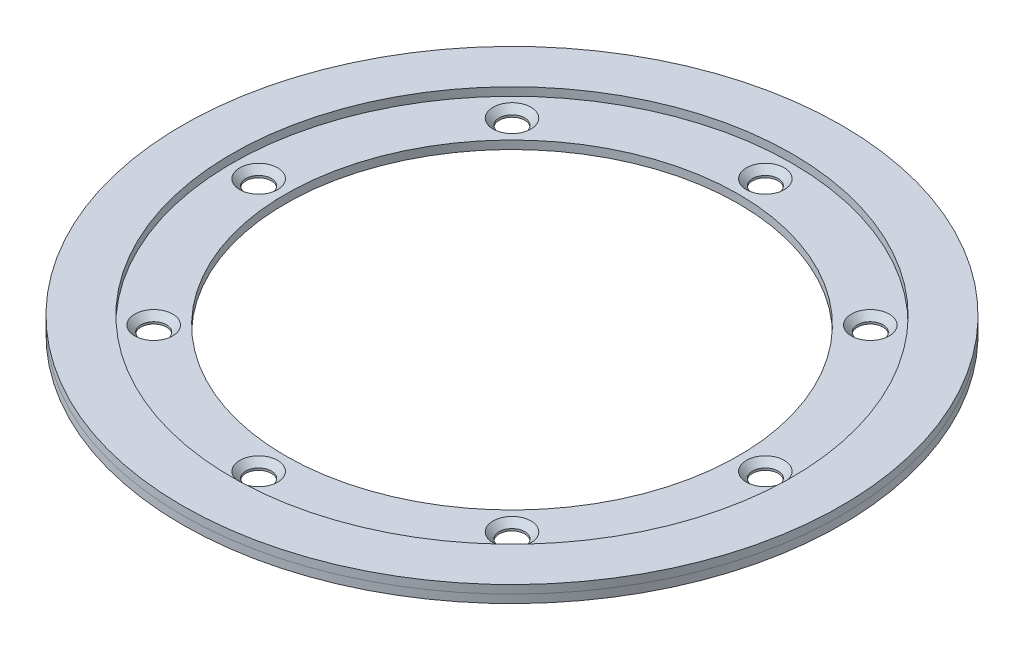
ISO-10303-21;
HEADER;
FILE_DESCRIPTION(('STEP AP214'),'2;1');
FILE_NAME('part.step','',(''),(''),'','','');
FILE_SCHEMA(('AUTOMOTIVE_DESIGN { 1 0 10303 214 1 1 1 1 }'));
ENDSEC;
DATA;
#1=APPLICATION_CONTEXT('core data for automotive mechanical design processes');
#2=APPLICATION_PROTOCOL_DEFINITION('international standard','automotive_design',2000,#1);
#3=PRODUCT_CONTEXT('',#1,'mechanical');
#4=PRODUCT('Part','Part','',(#3));
#5=PRODUCT_RELATED_PRODUCT_CATEGORY('part','',(#4));
#6=PRODUCT_DEFINITION_FORMATION('','',#4);
#7=PRODUCT_DEFINITION_CONTEXT('part definition',#1,'design');
#8=PRODUCT_DEFINITION('design','',#6,#7);
#9=PRODUCT_DEFINITION_SHAPE('','',#8);
#10=(LENGTH_UNIT() NAMED_UNIT(*) SI_UNIT(.MILLI.,.METRE.));
#11=(NAMED_UNIT(*) PLANE_ANGLE_UNIT() SI_UNIT($,.RADIAN.));
#12=(NAMED_UNIT(*) SI_UNIT($,.STERADIAN.) SOLID_ANGLE_UNIT());
#13=UNCERTAINTY_MEASURE_WITH_UNIT(LENGTH_MEASURE(1.E-05),#10,'distance_accuracy_value','');
#14=(GEOMETRIC_REPRESENTATION_CONTEXT(3) GLOBAL_UNCERTAINTY_ASSIGNED_CONTEXT((#13)) GLOBAL_UNIT_ASSIGNED_CONTEXT((#10,
#11,#12)) REPRESENTATION_CONTEXT('',''));
#15=CARTESIAN_POINT('',(0.,0.,0.));
#16=DIRECTION('',(0.,0.,1.));
#17=DIRECTION('',(1.,0.,0.));
#18=AXIS2_PLACEMENT_3D('',#15,#16,#17);
#19=CARTESIAN_POINT('',(0.,1.,-34.));
#20=DIRECTION('',(0.,1.,0.));
#21=DIRECTION('',(0.,0.,1.));
#22=AXIS2_PLACEMENT_3D('',#19,#20,#21);
#23=PLANE('',#22);
#24=CARTESIAN_POINT('',(0.,1.,0.));
#25=DIRECTION('',(0.,1.,0.));
#26=DIRECTION('',(0.,0.,1.));
#27=AXIS2_PLACEMENT_3D('',#24,#25,#26);
#28=CIRCLE('',#27,40.);
#29=CARTESIAN_POINT('',(0.,1.,40.));
#30=VERTEX_POINT('',#29);
#31=EDGE_CURVE('E47',#30,#30,#28,.T.);
#32=ORIENTED_EDGE('',*,*,#31,.T.);
#33=EDGE_LOOP('',(#32));
#34=FACE_BOUND('',#33,.T.);
#35=CARTESIAN_POINT('',(-21.7435335214861,1.,-21.7435335214866));
#36=DIRECTION('',(0.,1.,0.));
#37=DIRECTION('',(0.,0.,1.));
#38=AXIS2_PLACEMENT_3D('',#35,#36,#37);
#39=CIRCLE('',#38,2.3);
#40=CARTESIAN_POINT('',(-21.7435335214861,1.,-19.4435335214866));
#41=VERTEX_POINT('',#40);
#42=EDGE_CURVE('E11',#41,#41,#39,.T.);
#43=ORIENTED_EDGE('',*,*,#42,.F.);
#44=EDGE_LOOP('',(#43));
#45=FACE_BOUND('',#44,.T.);
#46=CARTESIAN_POINT('',(-30.75,1.,-3.22089153508279E-13));
#47=DIRECTION('',(0.,1.,0.));
#48=DIRECTION('',(0.,0.,1.));
#49=AXIS2_PLACEMENT_3D('',#46,#47,#48);
#50=CIRCLE('',#49,2.3);
#51=CARTESIAN_POINT('',(-30.75,1.,2.29999999999968));
#52=VERTEX_POINT('',#51);
#53=EDGE_CURVE('E60',#52,#52,#50,.T.);
#54=ORIENTED_EDGE('',*,*,#53,.F.);
#55=EDGE_LOOP('',(#54));
#56=FACE_BOUND('',#55,.T.);
#57=CARTESIAN_POINT('',(-21.7435335214865,1.,21.7435335214861));
#58=DIRECTION('',(0.,1.,0.));
#59=DIRECTION('',(0.,0.,1.));
#60=AXIS2_PLACEMENT_3D('',#57,#58,#59);
#61=CIRCLE('',#60,2.3);
#62=CARTESIAN_POINT('',(-21.7435335214865,1.,24.0435335214861));
#63=VERTEX_POINT('',#62);
#64=EDGE_CURVE('E69',#63,#63,#61,.T.);
#65=ORIENTED_EDGE('',*,*,#64,.F.);
#66=EDGE_LOOP('',(#65));
#67=FACE_BOUND('',#66,.T.);
#68=CARTESIAN_POINT('',(0.,1.,30.75));
#69=DIRECTION('',(0.,1.,0.));
#70=DIRECTION('',(0.,0.,1.));
#71=AXIS2_PLACEMENT_3D('',#68,#69,#70);
#72=CIRCLE('',#71,2.3);
#73=CARTESIAN_POINT('',(0.,1.,33.05));
#74=VERTEX_POINT('',#73);
#75=EDGE_CURVE('E78',#74,#74,#72,.T.);
#76=ORIENTED_EDGE('',*,*,#75,.F.);
#77=EDGE_LOOP('',(#76));
#78=FACE_BOUND('',#77,.T.);
#79=CARTESIAN_POINT('',(21.7435335214862,1.,21.7435335214865));
#80=DIRECTION('',(0.,1.,0.));
#81=DIRECTION('',(0.,0.,1.));
#82=AXIS2_PLACEMENT_3D('',#79,#80,#81);
#83=CIRCLE('',#82,2.3);
#84=CARTESIAN_POINT('',(21.7435335214862,1.,24.0435335214864));
#85=VERTEX_POINT('',#84);
#86=EDGE_CURVE('E87',#85,#85,#83,.T.);
#87=ORIENTED_EDGE('',*,*,#86,.F.);
#88=EDGE_LOOP('',(#87));
#89=FACE_BOUND('',#88,.T.);
#90=CARTESIAN_POINT('',(30.75,1.,1.07363051169426E-13));
#91=DIRECTION('',(0.,1.,0.));
#92=DIRECTION('',(0.,0.,1.));
#93=AXIS2_PLACEMENT_3D('',#90,#91,#92);
#94=CIRCLE('',#93,2.3);
#95=CARTESIAN_POINT('',(30.75,1.,2.3000000000001));
#96=VERTEX_POINT('',#95);
#97=EDGE_CURVE('E96',#96,#96,#94,.T.);
#98=ORIENTED_EDGE('',*,*,#97,.F.);
#99=EDGE_LOOP('',(#98));
#100=FACE_BOUND('',#99,.T.);
#101=CARTESIAN_POINT('',(21.7435335214864,1.,-21.7435335214863));
#102=DIRECTION('',(0.,1.,0.));
#103=DIRECTION('',(0.,0.,1.));
#104=AXIS2_PLACEMENT_3D('',#101,#102,#103);
#105=CIRCLE('',#104,2.3);
#106=CARTESIAN_POINT('',(21.7435335214864,1.,-19.4435335214863));
#107=VERTEX_POINT('',#106);
#108=EDGE_CURVE('E105',#107,#107,#105,.T.);
#109=ORIENTED_EDGE('',*,*,#108,.F.);
#110=EDGE_LOOP('',(#109));
#111=FACE_BOUND('',#110,.T.);
#112=CARTESIAN_POINT('',(0.,1.,-30.75));
#113=DIRECTION('',(0.,1.,0.));
#114=DIRECTION('',(0.,0.,1.));
#115=AXIS2_PLACEMENT_3D('',#112,#113,#114);
#116=CIRCLE('',#115,2.3);
#117=CARTESIAN_POINT('',(0.,1.,-28.45));
#118=VERTEX_POINT('',#117);
#119=EDGE_CURVE('E114',#118,#118,#116,.T.);
#120=ORIENTED_EDGE('',*,*,#119,.F.);
#121=EDGE_LOOP('',(#120));
#122=FACE_BOUND('',#121,.T.);
#123=CARTESIAN_POINT('',(0.,1.,0.));
#124=DIRECTION('',(0.,-1.,0.));
#125=DIRECTION('',(0.,0.,-1.));
#126=AXIS2_PLACEMENT_3D('',#123,#124,#125);
#127=CIRCLE('',#126,27.5);
#128=CARTESIAN_POINT('',(0.,1.,-27.5));
#129=VERTEX_POINT('',#128);
#130=EDGE_CURVE('E129',#129,#129,#127,.T.);
#131=ORIENTED_EDGE('',*,*,#130,.T.);
#132=EDGE_LOOP('',(#131));
#133=FACE_BOUND('',#132,.T.);
#134=ADVANCED_FACE('F43',(#34,#45,#56,#67,#78,#89,#100,#111,#122,#133),#23,.T.);
#135=CARTESIAN_POINT('',(-40.,0.,0.));
#136=DIRECTION('',(0.,1.,0.));
#137=DIRECTION('',(0.,0.,1.));
#138=AXIS2_PLACEMENT_3D('',#135,#136,#137);
#139=PLANE('',#138);
#140=CARTESIAN_POINT('',(-21.7435335214861,0.,-21.7435335214866));
#141=DIRECTION('',(0.,1.,0.));
#142=DIRECTION('',(0.,0.,1.));
#143=AXIS2_PLACEMENT_3D('',#140,#141,#142);
#144=CIRCLE('',#143,1.54999999999999);
#145=CARTESIAN_POINT('',(-21.7435335214861,0.,-20.1935335214866));
#146=VERTEX_POINT('',#145);
#147=EDGE_CURVE('E55',#146,#146,#144,.T.);
#148=ORIENTED_EDGE('',*,*,#147,.T.);
#149=EDGE_LOOP('',(#148));
#150=FACE_BOUND('',#149,.T.);
#151=CARTESIAN_POINT('',(-30.75,0.,-3.22089153508279E-13));
#152=DIRECTION('',(0.,1.,0.));
#153=DIRECTION('',(0.,0.,1.));
#154=AXIS2_PLACEMENT_3D('',#151,#152,#153);
#155=CIRCLE('',#154,1.54999999999999);
#156=CARTESIAN_POINT('',(-30.75,0.,1.54999999999967));
#157=VERTEX_POINT('',#156);
#158=EDGE_CURVE('E66',#157,#157,#155,.T.);
#159=ORIENTED_EDGE('',*,*,#158,.T.);
#160=EDGE_LOOP('',(#159));
#161=FACE_BOUND('',#160,.T.);
#162=CARTESIAN_POINT('',(-21.7435335214865,0.,21.7435335214861));
#163=DIRECTION('',(0.,1.,0.));
#164=DIRECTION('',(0.,0.,1.));
#165=AXIS2_PLACEMENT_3D('',#162,#163,#164);
#166=CIRCLE('',#165,1.54999999999999);
#167=CARTESIAN_POINT('',(-21.7435335214865,0.,23.2935335214861));
#168=VERTEX_POINT('',#167);
#169=EDGE_CURVE('E75',#168,#168,#166,.T.);
#170=ORIENTED_EDGE('',*,*,#169,.T.);
#171=EDGE_LOOP('',(#170));
#172=FACE_BOUND('',#171,.T.);
#173=CARTESIAN_POINT('',(0.,0.,30.75));
#174=DIRECTION('',(0.,1.,0.));
#175=DIRECTION('',(0.,0.,1.));
#176=AXIS2_PLACEMENT_3D('',#173,#174,#175);
#177=CIRCLE('',#176,1.54999999999999);
#178=CARTESIAN_POINT('',(0.,0.,32.3));
#179=VERTEX_POINT('',#178);
#180=EDGE_CURVE('E84',#179,#179,#177,.T.);
#181=ORIENTED_EDGE('',*,*,#180,.T.);
#182=EDGE_LOOP('',(#181));
#183=FACE_BOUND('',#182,.T.);
#184=CARTESIAN_POINT('',(21.7435335214862,0.,21.7435335214865));
#185=DIRECTION('',(0.,1.,0.));
#186=DIRECTION('',(0.,0.,1.));
#187=AXIS2_PLACEMENT_3D('',#184,#185,#186);
#188=CIRCLE('',#187,1.54999999999999);
#189=CARTESIAN_POINT('',(21.7435335214862,0.,23.2935335214864));
#190=VERTEX_POINT('',#189);
#191=EDGE_CURVE('E93',#190,#190,#188,.T.);
#192=ORIENTED_EDGE('',*,*,#191,.T.);
#193=EDGE_LOOP('',(#192));
#194=FACE_BOUND('',#193,.T.);
#195=CARTESIAN_POINT('',(30.75,0.,1.07363051169426E-13));
#196=DIRECTION('',(0.,1.,0.));
#197=DIRECTION('',(0.,0.,1.));
#198=AXIS2_PLACEMENT_3D('',#195,#196,#197);
#199=CIRCLE('',#198,1.54999999999999);
#200=CARTESIAN_POINT('',(30.75,0.,1.5500000000001));
#201=VERTEX_POINT('',#200);
#202=EDGE_CURVE('E102',#201,#201,#199,.T.);
#203=ORIENTED_EDGE('',*,*,#202,.T.);
#204=EDGE_LOOP('',(#203));
#205=FACE_BOUND('',#204,.T.);
#206=CARTESIAN_POINT('',(21.7435335214864,0.,-21.7435335214863));
#207=DIRECTION('',(0.,1.,0.));
#208=DIRECTION('',(0.,0.,1.));
#209=AXIS2_PLACEMENT_3D('',#206,#207,#208);
#210=CIRCLE('',#209,1.54999999999999);
#211=CARTESIAN_POINT('',(21.7435335214864,0.,-20.1935335214863));
#212=VERTEX_POINT('',#211);
#213=EDGE_CURVE('E111',#212,#212,#210,.T.);
#214=ORIENTED_EDGE('',*,*,#213,.T.);
#215=EDGE_LOOP('',(#214));
#216=FACE_BOUND('',#215,.T.);
#217=CARTESIAN_POINT('',(0.,0.,-30.75));
#218=DIRECTION('',(0.,1.,0.));
#219=DIRECTION('',(0.,0.,1.));
#220=AXIS2_PLACEMENT_3D('',#217,#218,#219);
#221=CIRCLE('',#220,1.54999999999999);
#222=CARTESIAN_POINT('',(0.,0.,-29.2));
#223=VERTEX_POINT('',#222);
#224=EDGE_CURVE('E120',#223,#223,#221,.T.);
#225=ORIENTED_EDGE('',*,*,#224,.T.);
#226=EDGE_LOOP('',(#225));
#227=FACE_BOUND('',#226,.T.);
#228=CARTESIAN_POINT('',(0.,0.,0.));
#229=DIRECTION('',(0.,-1.,0.));
#230=DIRECTION('',(0.,0.,-1.));
#231=AXIS2_PLACEMENT_3D('',#228,#229,#230);
#232=CIRCLE('',#231,27.5);
#233=CARTESIAN_POINT('',(0.,0.,-27.5));
#234=VERTEX_POINT('',#233);
#235=EDGE_CURVE('E126',#234,#234,#232,.T.);
#236=ORIENTED_EDGE('',*,*,#235,.F.);
#237=EDGE_LOOP('',(#236));
#238=FACE_BOUND('',#237,.T.);
#239=CARTESIAN_POINT('',(0.,0.,0.));
#240=DIRECTION('',(0.,-1.,0.));
#241=DIRECTION('',(0.,0.,-1.));
#242=AXIS2_PLACEMENT_3D('',#239,#240,#241);
#243=CIRCLE('',#242,40.);
#244=CARTESIAN_POINT('',(0.,0.,-40.));
#245=VERTEX_POINT('',#244);
#246=EDGE_CURVE('E123',#245,#245,#243,.T.);
#247=ORIENTED_EDGE('',*,*,#246,.T.);
#248=EDGE_LOOP('',(#247));
#249=FACE_BOUND('',#248,.T.);
#250=ADVANCED_FACE('F149',(#150,#161,#172,#183,#194,#205,#216,#227,#238,#249),#139,.F.);
#251=CARTESIAN_POINT('',(0.,0.,0.));
#252=DIRECTION('',(0.,-1.,0.));
#253=DIRECTION('',(0.,0.,-1.));
#254=AXIS2_PLACEMENT_3D('',#251,#252,#253);
#255=CYLINDRICAL_SURFACE('',#254,27.5);
#256=ORIENTED_EDGE('',*,*,#130,.F.);
#257=EDGE_LOOP('',(#256));
#258=FACE_BOUND('',#257,.T.);
#259=ORIENTED_EDGE('',*,*,#235,.T.);
#260=EDGE_LOOP('',(#259));
#261=FACE_BOUND('',#260,.T.);
#262=ADVANCED_FACE('F140',(#258,#261),#255,.F.);
#263=CARTESIAN_POINT('',(0.,0.,0.));
#264=DIRECTION('',(0.,-1.,0.));
#265=DIRECTION('',(0.,0.,-1.));
#266=AXIS2_PLACEMENT_3D('',#263,#264,#265);
#267=CYLINDRICAL_SURFACE('',#266,40.);
#268=ORIENTED_EDGE('',*,*,#246,.F.);
#269=EDGE_LOOP('',(#268));
#270=FACE_BOUND('',#269,.T.);
#271=ORIENTED_EDGE('',*,*,#31,.F.);
#272=EDGE_LOOP('',(#271));
#273=FACE_BOUND('',#272,.T.);
#274=ADVANCED_FACE('F45',(#270,#273),#267,.T.);
#275=CARTESIAN_POINT('',(-21.7435335214861,1.,-21.7435335214866));
#276=DIRECTION('',(0.,1.,0.));
#277=DIRECTION('',(0.,0.,1.));
#278=AXIS2_PLACEMENT_3D('',#275,#276,#277);
#279=CYLINDRICAL_SURFACE('',#278,1.54999999999999);
#280=ORIENTED_EDGE('',*,*,#147,.F.);
#281=EDGE_LOOP('',(#280));
#282=FACE_BOUND('',#281,.T.);
#283=CARTESIAN_POINT('',(-21.7435335214861,0.249999999999999,-21.7435335214866));
#284=DIRECTION('',(0.,1.,0.));
#285=DIRECTION('',(0.,0.,1.));
#286=AXIS2_PLACEMENT_3D('',#283,#284,#285);
#287=CIRCLE('',#286,1.55);
#288=CARTESIAN_POINT('',(-21.7435335214861,0.249999999999999,-20.1935335214866));
#289=VERTEX_POINT('',#288);
#290=EDGE_CURVE('E51',#289,#289,#287,.T.);
#291=ORIENTED_EDGE('',*,*,#290,.T.);
#292=EDGE_LOOP('',(#291));
#293=FACE_BOUND('',#292,.T.);
#294=ADVANCED_FACE('F139',(#282,#293),#279,.F.);
#295=CARTESIAN_POINT('',(-21.7435335214861,1.,-21.7435335214866));
#296=DIRECTION('',(0.,1.,0.));
#297=DIRECTION('',(0.,0.,1.));
#298=AXIS2_PLACEMENT_3D('',#295,#296,#297);
#299=CONICAL_SURFACE('',#298,2.3,0.785398163397447);
#300=ORIENTED_EDGE('',*,*,#290,.F.);
#301=EDGE_LOOP('',(#300));
#302=FACE_BOUND('',#301,.T.);
#303=ORIENTED_EDGE('',*,*,#42,.T.);
#304=EDGE_LOOP('',(#303));
#305=FACE_BOUND('',#304,.T.);
#306=ADVANCED_FACE('F146',(#302,#305),#299,.F.);
#307=CARTESIAN_POINT('',(-30.75,1.,-3.22089153508279E-13));
#308=DIRECTION('',(0.,1.,0.));
#309=DIRECTION('',(0.,0.,1.));
#310=AXIS2_PLACEMENT_3D('',#307,#308,#309);
#311=CYLINDRICAL_SURFACE('',#310,1.54999999999999);
#312=ORIENTED_EDGE('',*,*,#158,.F.);
#313=EDGE_LOOP('',(#312));
#314=FACE_BOUND('',#313,.T.);
#315=CARTESIAN_POINT('',(-30.75,0.249999999999999,-3.22089153508279E-13));
#316=DIRECTION('',(0.,1.,0.));
#317=DIRECTION('',(0.,0.,1.));
#318=AXIS2_PLACEMENT_3D('',#315,#316,#317);
#319=CIRCLE('',#318,1.55);
#320=CARTESIAN_POINT('',(-30.75,0.249999999999999,1.54999999999968));
#321=VERTEX_POINT('',#320);
#322=EDGE_CURVE('E63',#321,#321,#319,.T.);
#323=ORIENTED_EDGE('',*,*,#322,.T.);
#324=EDGE_LOOP('',(#323));
#325=FACE_BOUND('',#324,.T.);
#326=ADVANCED_FACE('F210',(#314,#325),#311,.F.);
#327=CARTESIAN_POINT('',(-30.75,1.,-3.22089153508279E-13));
#328=DIRECTION('',(0.,1.,0.));
#329=DIRECTION('',(0.,0.,1.));
#330=AXIS2_PLACEMENT_3D('',#327,#328,#329);
#331=CONICAL_SURFACE('',#330,2.3,0.785398163397447);
#332=ORIENTED_EDGE('',*,*,#322,.F.);
#333=EDGE_LOOP('',(#332));
#334=FACE_BOUND('',#333,.T.);
#335=ORIENTED_EDGE('',*,*,#53,.T.);
#336=EDGE_LOOP('',(#335));
#337=FACE_BOUND('',#336,.T.);
#338=ADVANCED_FACE('F205',(#334,#337),#331,.F.);
#339=CARTESIAN_POINT('',(-21.7435335214865,1.,21.7435335214861));
#340=DIRECTION('',(0.,1.,0.));
#341=DIRECTION('',(0.,0.,1.));
#342=AXIS2_PLACEMENT_3D('',#339,#340,#341);
#343=CYLINDRICAL_SURFACE('',#342,1.54999999999999);
#344=ORIENTED_EDGE('',*,*,#169,.F.);
#345=EDGE_LOOP('',(#344));
#346=FACE_BOUND('',#345,.T.);
#347=CARTESIAN_POINT('',(-21.7435335214865,0.249999999999999,21.7435335214861));
#348=DIRECTION('',(0.,1.,0.));
#349=DIRECTION('',(0.,0.,1.));
#350=AXIS2_PLACEMENT_3D('',#347,#348,#349);
#351=CIRCLE('',#350,1.55);
#352=CARTESIAN_POINT('',(-21.7435335214865,0.249999999999999,23.2935335214861));
#353=VERTEX_POINT('',#352);
#354=EDGE_CURVE('E72',#353,#353,#351,.T.);
#355=ORIENTED_EDGE('',*,*,#354,.T.);
#356=EDGE_LOOP('',(#355));
#357=FACE_BOUND('',#356,.T.);
#358=ADVANCED_FACE('F202',(#346,#357),#343,.F.);
#359=CARTESIAN_POINT('',(-21.7435335214865,1.,21.7435335214861));
#360=DIRECTION('',(0.,1.,0.));
#361=DIRECTION('',(0.,0.,1.));
#362=AXIS2_PLACEMENT_3D('',#359,#360,#361);
#363=CONICAL_SURFACE('',#362,2.3,0.785398163397447);
#364=ORIENTED_EDGE('',*,*,#354,.F.);
#365=EDGE_LOOP('',(#364));
#366=FACE_BOUND('',#365,.T.);
#367=ORIENTED_EDGE('',*,*,#64,.T.);
#368=EDGE_LOOP('',(#367));
#369=FACE_BOUND('',#368,.T.);
#370=ADVANCED_FACE('F197',(#366,#369),#363,.F.);
#371=CARTESIAN_POINT('',(0.,1.,30.75));
#372=DIRECTION('',(0.,1.,0.));
#373=DIRECTION('',(0.,0.,1.));
#374=AXIS2_PLACEMENT_3D('',#371,#372,#373);
#375=CYLINDRICAL_SURFACE('',#374,1.54999999999999);
#376=ORIENTED_EDGE('',*,*,#180,.F.);
#377=EDGE_LOOP('',(#376));
#378=FACE_BOUND('',#377,.T.);
#379=CARTESIAN_POINT('',(0.,0.249999999999999,30.75));
#380=DIRECTION('',(0.,1.,0.));
#381=DIRECTION('',(0.,0.,1.));
#382=AXIS2_PLACEMENT_3D('',#379,#380,#381);
#383=CIRCLE('',#382,1.55);
#384=CARTESIAN_POINT('',(0.,0.249999999999999,32.3));
#385=VERTEX_POINT('',#384);
#386=EDGE_CURVE('E81',#385,#385,#383,.T.);
#387=ORIENTED_EDGE('',*,*,#386,.T.);
#388=EDGE_LOOP('',(#387));
#389=FACE_BOUND('',#388,.T.);
#390=ADVANCED_FACE('F194',(#378,#389),#375,.F.);
#391=CARTESIAN_POINT('',(0.,1.,30.75));
#392=DIRECTION('',(0.,1.,0.));
#393=DIRECTION('',(0.,0.,1.));
#394=AXIS2_PLACEMENT_3D('',#391,#392,#393);
#395=CONICAL_SURFACE('',#394,2.3,0.785398163397447);
#396=ORIENTED_EDGE('',*,*,#386,.F.);
#397=EDGE_LOOP('',(#396));
#398=FACE_BOUND('',#397,.T.);
#399=ORIENTED_EDGE('',*,*,#75,.T.);
#400=EDGE_LOOP('',(#399));
#401=FACE_BOUND('',#400,.T.);
#402=ADVANCED_FACE('F189',(#398,#401),#395,.F.);
#403=CARTESIAN_POINT('',(21.7435335214862,1.,21.7435335214865));
#404=DIRECTION('',(0.,1.,0.));
#405=DIRECTION('',(0.,0.,1.));
#406=AXIS2_PLACEMENT_3D('',#403,#404,#405);
#407=CYLINDRICAL_SURFACE('',#406,1.54999999999999);
#408=ORIENTED_EDGE('',*,*,#191,.F.);
#409=EDGE_LOOP('',(#408));
#410=FACE_BOUND('',#409,.T.);
#411=CARTESIAN_POINT('',(21.7435335214862,0.249999999999999,21.7435335214865));
#412=DIRECTION('',(0.,1.,0.));
#413=DIRECTION('',(0.,0.,1.));
#414=AXIS2_PLACEMENT_3D('',#411,#412,#413);
#415=CIRCLE('',#414,1.55);
#416=CARTESIAN_POINT('',(21.7435335214862,0.249999999999999,23.2935335214864));
#417=VERTEX_POINT('',#416);
#418=EDGE_CURVE('E90',#417,#417,#415,.T.);
#419=ORIENTED_EDGE('',*,*,#418,.T.);
#420=EDGE_LOOP('',(#419));
#421=FACE_BOUND('',#420,.T.);
#422=ADVANCED_FACE('F186',(#410,#421),#407,.F.);
#423=CARTESIAN_POINT('',(21.7435335214862,1.,21.7435335214865));
#424=DIRECTION('',(0.,1.,0.));
#425=DIRECTION('',(0.,0.,1.));
#426=AXIS2_PLACEMENT_3D('',#423,#424,#425);
#427=CONICAL_SURFACE('',#426,2.3,0.785398163397447);
#428=ORIENTED_EDGE('',*,*,#418,.F.);
#429=EDGE_LOOP('',(#428));
#430=FACE_BOUND('',#429,.T.);
#431=ORIENTED_EDGE('',*,*,#86,.T.);
#432=EDGE_LOOP('',(#431));
#433=FACE_BOUND('',#432,.T.);
#434=ADVANCED_FACE('F181',(#430,#433),#427,.F.);
#435=CARTESIAN_POINT('',(30.75,1.,1.07363051169426E-13));
#436=DIRECTION('',(0.,1.,0.));
#437=DIRECTION('',(0.,0.,1.));
#438=AXIS2_PLACEMENT_3D('',#435,#436,#437);
#439=CYLINDRICAL_SURFACE('',#438,1.55);
#440=ORIENTED_EDGE('',*,*,#202,.F.);
#441=EDGE_LOOP('',(#440));
#442=FACE_BOUND('',#441,.T.);
#443=CARTESIAN_POINT('',(30.75,0.249999999999999,1.07363051169426E-13));
#444=DIRECTION('',(0.,1.,0.));
#445=DIRECTION('',(0.,0.,1.));
#446=AXIS2_PLACEMENT_3D('',#443,#444,#445);
#447=CIRCLE('',#446,1.55);
#448=CARTESIAN_POINT('',(30.75,0.249999999999999,1.55000000000011));
#449=VERTEX_POINT('',#448);
#450=EDGE_CURVE('E99',#449,#449,#447,.T.);
#451=ORIENTED_EDGE('',*,*,#450,.T.);
#452=EDGE_LOOP('',(#451));
#453=FACE_BOUND('',#452,.T.);
#454=ADVANCED_FACE('F178',(#442,#453),#439,.F.);
#455=CARTESIAN_POINT('',(30.75,1.,1.07363051169426E-13));
#456=DIRECTION('',(0.,1.,0.));
#457=DIRECTION('',(0.,0.,1.));
#458=AXIS2_PLACEMENT_3D('',#455,#456,#457);
#459=CONICAL_SURFACE('',#458,2.3,0.785398163397443);
#460=ORIENTED_EDGE('',*,*,#450,.F.);
#461=EDGE_LOOP('',(#460));
#462=FACE_BOUND('',#461,.T.);
#463=ORIENTED_EDGE('',*,*,#97,.T.);
#464=EDGE_LOOP('',(#463));
#465=FACE_BOUND('',#464,.T.);
#466=ADVANCED_FACE('F173',(#462,#465),#459,.F.);
#467=CARTESIAN_POINT('',(21.7435335214864,1.,-21.7435335214863));
#468=DIRECTION('',(0.,1.,0.));
#469=DIRECTION('',(0.,0.,1.));
#470=AXIS2_PLACEMENT_3D('',#467,#468,#469);
#471=CYLINDRICAL_SURFACE('',#470,1.54999999999999);
#472=ORIENTED_EDGE('',*,*,#213,.F.);
#473=EDGE_LOOP('',(#472));
#474=FACE_BOUND('',#473,.T.);
#475=CARTESIAN_POINT('',(21.7435335214864,0.249999999999999,-21.7435335214863));
#476=DIRECTION('',(0.,1.,0.));
#477=DIRECTION('',(0.,0.,1.));
#478=AXIS2_PLACEMENT_3D('',#475,#476,#477);
#479=CIRCLE('',#478,1.55);
#480=CARTESIAN_POINT('',(21.7435335214864,0.249999999999999,-20.1935335214863));
#481=VERTEX_POINT('',#480);
#482=EDGE_CURVE('E108',#481,#481,#479,.T.);
#483=ORIENTED_EDGE('',*,*,#482,.T.);
#484=EDGE_LOOP('',(#483));
#485=FACE_BOUND('',#484,.T.);
#486=ADVANCED_FACE('F170',(#474,#485),#471,.F.);
#487=CARTESIAN_POINT('',(21.7435335214864,1.,-21.7435335214863));
#488=DIRECTION('',(0.,1.,0.));
#489=DIRECTION('',(0.,0.,1.));
#490=AXIS2_PLACEMENT_3D('',#487,#488,#489);
#491=CONICAL_SURFACE('',#490,2.3,0.785398163397447);
#492=ORIENTED_EDGE('',*,*,#482,.F.);
#493=EDGE_LOOP('',(#492));
#494=FACE_BOUND('',#493,.T.);
#495=ORIENTED_EDGE('',*,*,#108,.T.);
#496=EDGE_LOOP('',(#495));
#497=FACE_BOUND('',#496,.T.);
#498=ADVANCED_FACE('F165',(#494,#497),#491,.F.);
#499=CARTESIAN_POINT('',(0.,1.,-30.75));
#500=DIRECTION('',(0.,1.,0.));
#501=DIRECTION('',(0.,0.,1.));
#502=AXIS2_PLACEMENT_3D('',#499,#500,#501);
#503=CYLINDRICAL_SURFACE('',#502,1.54999999999999);
#504=ORIENTED_EDGE('',*,*,#224,.F.);
#505=EDGE_LOOP('',(#504));
#506=FACE_BOUND('',#505,.T.);
#507=CARTESIAN_POINT('',(0.,0.249999999999999,-30.75));
#508=DIRECTION('',(0.,1.,0.));
#509=DIRECTION('',(0.,0.,1.));
#510=AXIS2_PLACEMENT_3D('',#507,#508,#509);
#511=CIRCLE('',#510,1.55);
#512=CARTESIAN_POINT('',(0.,0.249999999999999,-29.2));
#513=VERTEX_POINT('',#512);
#514=EDGE_CURVE('E117',#513,#513,#511,.T.);
#515=ORIENTED_EDGE('',*,*,#514,.T.);
#516=EDGE_LOOP('',(#515));
#517=FACE_BOUND('',#516,.T.);
#518=ADVANCED_FACE('F162',(#506,#517),#503,.F.);
#519=CARTESIAN_POINT('',(0.,1.,-30.75));
#520=DIRECTION('',(0.,1.,0.));
#521=DIRECTION('',(0.,0.,1.));
#522=AXIS2_PLACEMENT_3D('',#519,#520,#521);
#523=CONICAL_SURFACE('',#522,2.3,0.785398163397447);
#524=ORIENTED_EDGE('',*,*,#514,.F.);
#525=EDGE_LOOP('',(#524));
#526=FACE_BOUND('',#525,.T.);
#527=ORIENTED_EDGE('',*,*,#119,.T.);
#528=EDGE_LOOP('',(#527));
#529=FACE_BOUND('',#528,.T.);
#530=ADVANCED_FACE('F159',(#526,#529),#523,.F.);
#531=CLOSED_SHELL('',(#134,#250,#262,#274,#294,#306,#326,#338,#358,#370,#390,#402,#422,#434,
#454,#466,#486,#498,#518,#530));
#532=MANIFOLD_SOLID_BREP('B2',#531);
#533=CARTESIAN_POINT('',(0.,1.,-34.));
#534=DIRECTION('',(0.,1.,0.));
#535=DIRECTION('',(0.,0.,1.));
#536=AXIS2_PLACEMENT_3D('',#533,#534,#535);
#537=PLANE('',#536);
#538=CARTESIAN_POINT('',(0.,1.,0.));
#539=DIRECTION('',(0.,-1.,0.));
#540=DIRECTION('',(0.,0.,-1.));
#541=AXIS2_PLACEMENT_3D('',#538,#539,#540);
#542=CIRCLE('',#541,34.);
#543=CARTESIAN_POINT('',(0.,1.,-34.));
#544=VERTEX_POINT('',#543);
#545=EDGE_CURVE('E410',#544,#544,#542,.T.);
#546=ORIENTED_EDGE('',*,*,#545,.F.);
#547=EDGE_LOOP('',(#546));
#548=FACE_BOUND('',#547,.T.);
#549=CARTESIAN_POINT('',(0.,1.,0.));
#550=DIRECTION('',(0.,1.,0.));
#551=DIRECTION('',(0.,0.,1.));
#552=AXIS2_PLACEMENT_3D('',#549,#550,#551);
#553=CIRCLE('',#552,40.);
#554=CARTESIAN_POINT('',(0.,1.,40.));
#555=VERTEX_POINT('',#554);
#556=EDGE_CURVE('E42',#555,#555,#553,.T.);
#557=ORIENTED_EDGE('',*,*,#556,.F.);
#558=EDGE_LOOP('',(#557));
#559=FACE_BOUND('',#558,.T.);
#560=ADVANCED_FACE('F396',(#548,#559),#537,.F.);
#561=CARTESIAN_POINT('',(0.,0.,0.));
#562=DIRECTION('',(0.,-1.,0.));
#563=DIRECTION('',(0.,0.,-1.));
#564=AXIS2_PLACEMENT_3D('',#561,#562,#563);
#565=CYLINDRICAL_SURFACE('',#564,40.);
#566=ORIENTED_EDGE('',*,*,#556,.T.);
#567=EDGE_LOOP('',(#566));
#568=FACE_BOUND('',#567,.T.);
#569=CARTESIAN_POINT('',(0.,2.,0.));
#570=DIRECTION('',(0.,-1.,0.));
#571=DIRECTION('',(0.,0.,-1.));
#572=AXIS2_PLACEMENT_3D('',#569,#570,#571);
#573=CIRCLE('',#572,40.);
#574=CARTESIAN_POINT('',(0.,2.,-40.));
#575=VERTEX_POINT('',#574);
#576=EDGE_CURVE('E402',#575,#575,#573,.T.);
#577=ORIENTED_EDGE('',*,*,#576,.T.);
#578=EDGE_LOOP('',(#577));
#579=FACE_BOUND('',#578,.T.);
#580=ADVANCED_FACE('F420',(#568,#579),#565,.T.);
#581=CARTESIAN_POINT('',(-40.,2.,0.));
#582=DIRECTION('',(0.,-1.,0.));
#583=DIRECTION('',(0.,0.,-1.));
#584=AXIS2_PLACEMENT_3D('',#581,#582,#583);
#585=PLANE('',#584);
#586=ORIENTED_EDGE('',*,*,#576,.F.);
#587=EDGE_LOOP('',(#586));
#588=FACE_BOUND('',#587,.T.);
#589=CARTESIAN_POINT('',(0.,2.,0.));
#590=DIRECTION('',(0.,-1.,0.));
#591=DIRECTION('',(0.,0.,-1.));
#592=AXIS2_PLACEMENT_3D('',#589,#590,#591);
#593=CIRCLE('',#592,34.);
#594=CARTESIAN_POINT('',(0.,2.,-34.));
#595=VERTEX_POINT('',#594);
#596=EDGE_CURVE('E406',#595,#595,#593,.T.);
#597=ORIENTED_EDGE('',*,*,#596,.T.);
#598=EDGE_LOOP('',(#597));
#599=FACE_BOUND('',#598,.T.);
#600=ADVANCED_FACE('F424',(#588,#599),#585,.F.);
#601=CARTESIAN_POINT('',(0.,0.,0.));
#602=DIRECTION('',(0.,-1.,0.));
#603=DIRECTION('',(0.,0.,-1.));
#604=AXIS2_PLACEMENT_3D('',#601,#602,#603);
#605=CYLINDRICAL_SURFACE('',#604,34.);
#606=ORIENTED_EDGE('',*,*,#596,.F.);
#607=EDGE_LOOP('',(#606));
#608=FACE_BOUND('',#607,.T.);
#609=ORIENTED_EDGE('',*,*,#545,.T.);
#610=EDGE_LOOP('',(#609));
#611=FACE_BOUND('',#610,.T.);
#612=ADVANCED_FACE('F416',(#608,#611),#605,.F.);
#613=CLOSED_SHELL('',(#560,#580,#600,#612));
#614=MANIFOLD_SOLID_BREP('B6',#613);
#615=ADVANCED_BREP_SHAPE_REPRESENTATION('',(#18,#532,#614),#14);
#616=SHAPE_DEFINITION_REPRESENTATION(#9,#615);
ENDSEC;
END-ISO-10303-21;
